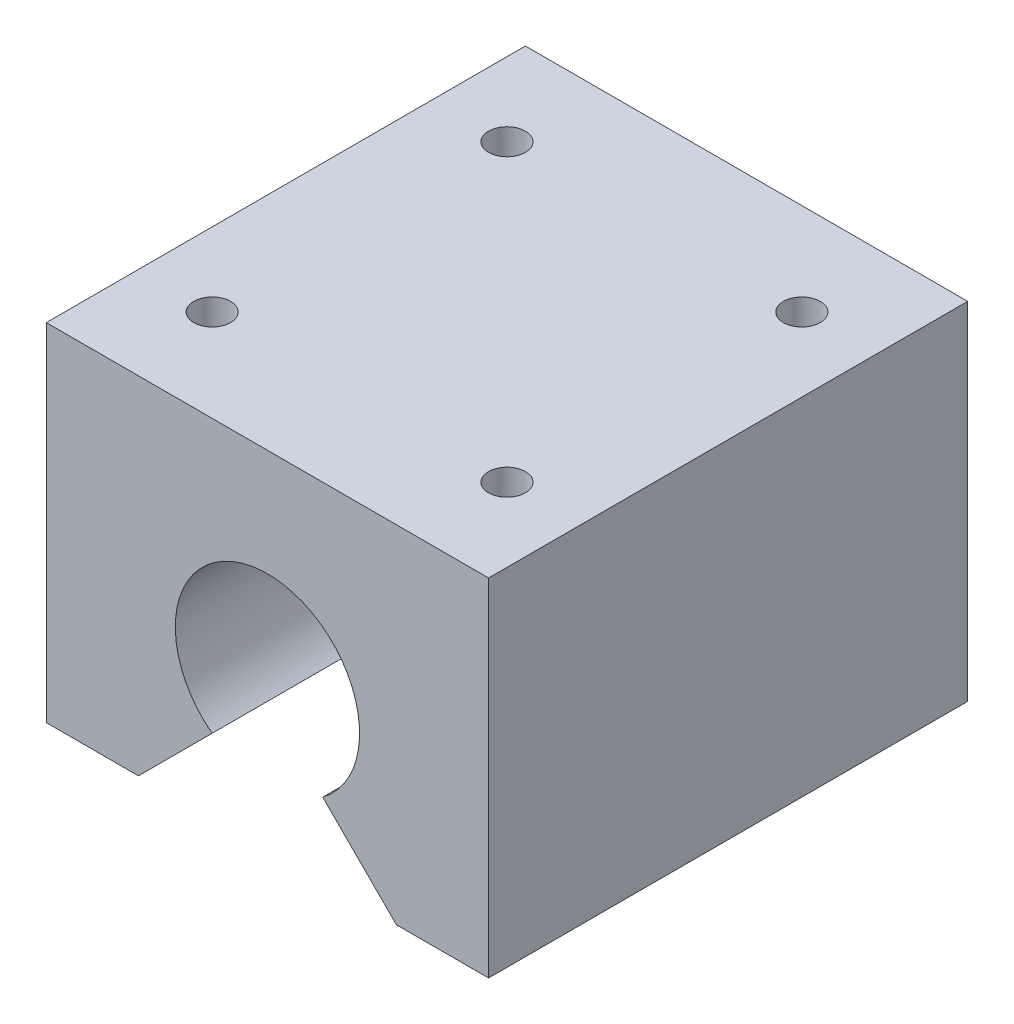
ISO-10303-21;
HEADER;
FILE_DESCRIPTION(('STEP AP214'),'2;1');
FILE_NAME('part.step','',(''),(''),'','','');
FILE_SCHEMA(('AUTOMOTIVE_DESIGN { 1 0 10303 214 1 1 1 1 }'));
ENDSEC;
DATA;
#1=APPLICATION_CONTEXT('core data for automotive mechanical design processes');
#2=APPLICATION_PROTOCOL_DEFINITION('international standard','automotive_design',2000,#1);
#3=PRODUCT_CONTEXT('',#1,'mechanical');
#4=PRODUCT('Part','Part','',(#3));
#5=PRODUCT_RELATED_PRODUCT_CATEGORY('part','',(#4));
#6=PRODUCT_DEFINITION_FORMATION('','',#4);
#7=PRODUCT_DEFINITION_CONTEXT('part definition',#1,'design');
#8=PRODUCT_DEFINITION('design','',#6,#7);
#9=PRODUCT_DEFINITION_SHAPE('','',#8);
#10=(LENGTH_UNIT() NAMED_UNIT(*) SI_UNIT(.MILLI.,.METRE.));
#11=(NAMED_UNIT(*) PLANE_ANGLE_UNIT() SI_UNIT($,.RADIAN.));
#12=(NAMED_UNIT(*) SI_UNIT($,.STERADIAN.) SOLID_ANGLE_UNIT());
#13=UNCERTAINTY_MEASURE_WITH_UNIT(LENGTH_MEASURE(1.E-05),#10,'distance_accuracy_value','');
#14=(GEOMETRIC_REPRESENTATION_CONTEXT(3) GLOBAL_UNCERTAINTY_ASSIGNED_CONTEXT((#13)) GLOBAL_UNIT_ASSIGNED_CONTEXT((#10,
#11,#12)) REPRESENTATION_CONTEXT('',''));
#15=CARTESIAN_POINT('',(0.,0.,0.));
#16=DIRECTION('',(0.,0.,1.));
#17=DIRECTION('',(1.,0.,0.));
#18=AXIS2_PLACEMENT_3D('',#15,#16,#17);
#19=CARTESIAN_POINT('',(17.5,0.,32.5));
#20=DIRECTION('',(0.,1.,0.));
#21=DIRECTION('',(-1.,0.,0.));
#22=AXIS2_PLACEMENT_3D('',#19,#20,#21);
#23=PLANE('',#22);
#24=DIRECTION('',(1.,0.,0.));
#25=VECTOR('',#24,1.);
#26=CARTESIAN_POINT('',(17.5,0.,-32.5));
#27=LINE('',#26,#25);
#28=CARTESIAN_POINT('',(17.5,0.,-32.5));
#29=VERTEX_POINT('',#28);
#30=CARTESIAN_POINT('',(30.,0.,-32.5));
#31=VERTEX_POINT('',#30);
#32=EDGE_CURVE('E136',#29,#31,#27,.T.);
#33=ORIENTED_EDGE('',*,*,#32,.T.);
#34=DIRECTION('',(0.,0.,-1.));
#35=VECTOR('',#34,1.);
#36=CARTESIAN_POINT('',(30.,0.,32.5));
#37=LINE('',#36,#35);
#38=CARTESIAN_POINT('',(30.,0.,32.5));
#39=VERTEX_POINT('',#38);
#40=EDGE_CURVE('E11',#39,#31,#37,.T.);
#41=ORIENTED_EDGE('',*,*,#40,.F.);
#42=DIRECTION('',(1.,0.,0.));
#43=VECTOR('',#42,1.);
#44=CARTESIAN_POINT('',(17.5,0.,32.5));
#45=LINE('',#44,#43);
#46=CARTESIAN_POINT('',(17.5,0.,32.5));
#47=VERTEX_POINT('',#46);
#48=EDGE_CURVE('E151',#47,#39,#45,.T.);
#49=ORIENTED_EDGE('',*,*,#48,.F.);
#50=DIRECTION('',(0.,0.,-1.));
#51=VECTOR('',#50,1.);
#52=CARTESIAN_POINT('',(17.5,0.,32.5));
#53=LINE('',#52,#51);
#54=EDGE_CURVE('E132',#47,#29,#53,.T.);
#55=ORIENTED_EDGE('',*,*,#54,.T.);
#56=EDGE_LOOP('',(#33,#41,#49,#55));
#57=FACE_BOUND('',#56,.T.);
#58=ADVANCED_FACE('F37',(#57),#23,.F.);
#59=CARTESIAN_POINT('',(30.,47.,32.5));
#60=DIRECTION('',(-1.,0.,0.));
#61=DIRECTION('',(0.,-1.,0.));
#62=AXIS2_PLACEMENT_3D('',#59,#60,#61);
#63=PLANE('',#62);
#64=DIRECTION('',(0.,1.,0.));
#65=VECTOR('',#64,1.);
#66=CARTESIAN_POINT('',(30.,47.,-32.5));
#67=LINE('',#66,#65);
#68=CARTESIAN_POINT('',(30.,47.,-32.5));
#69=VERTEX_POINT('',#68);
#70=EDGE_CURVE('E139',#31,#69,#67,.T.);
#71=ORIENTED_EDGE('',*,*,#70,.T.);
#72=DIRECTION('',(0.,0.,-1.));
#73=VECTOR('',#72,1.);
#74=CARTESIAN_POINT('',(30.,47.,32.5));
#75=LINE('',#74,#73);
#76=CARTESIAN_POINT('',(30.,47.,32.5));
#77=VERTEX_POINT('',#76);
#78=EDGE_CURVE('E45',#77,#69,#75,.T.);
#79=ORIENTED_EDGE('',*,*,#78,.F.);
#80=DIRECTION('',(0.,1.,0.));
#81=VECTOR('',#80,1.);
#82=CARTESIAN_POINT('',(30.,47.,32.5));
#83=LINE('',#82,#81);
#84=EDGE_CURVE('E97',#39,#77,#83,.T.);
#85=ORIENTED_EDGE('',*,*,#84,.F.);
#86=ORIENTED_EDGE('',*,*,#40,.T.);
#87=EDGE_LOOP('',(#71,#79,#85,#86));
#88=FACE_BOUND('',#87,.T.);
#89=ADVANCED_FACE('F212',(#88),#63,.F.);
#90=CARTESIAN_POINT('',(-30.,47.,32.5));
#91=DIRECTION('',(0.,-1.,0.));
#92=DIRECTION('',(1.,0.,0.));
#93=AXIS2_PLACEMENT_3D('',#90,#91,#92);
#94=PLANE('',#93);
#95=CARTESIAN_POINT('',(-20.,47.,-20.));
#96=DIRECTION('',(0.,1.,0.));
#97=DIRECTION('',(0.,0.,1.));
#98=AXIS2_PLACEMENT_3D('',#95,#96,#97);
#99=CIRCLE('',#98,2.5);
#100=CARTESIAN_POINT('',(-20.,47.,-17.5));
#101=VERTEX_POINT('',#100);
#102=EDGE_CURVE('E204',#101,#101,#99,.T.);
#103=ORIENTED_EDGE('',*,*,#102,.F.);
#104=EDGE_LOOP('',(#103));
#105=FACE_BOUND('',#104,.T.);
#106=CARTESIAN_POINT('',(20.,47.,-20.));
#107=DIRECTION('',(0.,1.,0.));
#108=DIRECTION('',(0.,0.,1.));
#109=AXIS2_PLACEMENT_3D('',#106,#107,#108);
#110=CIRCLE('',#109,2.5);
#111=CARTESIAN_POINT('',(20.,47.,-17.5));
#112=VERTEX_POINT('',#111);
#113=EDGE_CURVE('E198',#112,#112,#110,.T.);
#114=ORIENTED_EDGE('',*,*,#113,.F.);
#115=EDGE_LOOP('',(#114));
#116=FACE_BOUND('',#115,.T.);
#117=CARTESIAN_POINT('',(20.,47.,20.));
#118=DIRECTION('',(0.,1.,0.));
#119=DIRECTION('',(0.,0.,1.));
#120=AXIS2_PLACEMENT_3D('',#117,#118,#119);
#121=CIRCLE('',#120,2.5);
#122=CARTESIAN_POINT('',(20.,47.,22.5));
#123=VERTEX_POINT('',#122);
#124=EDGE_CURVE('E192',#123,#123,#121,.T.);
#125=ORIENTED_EDGE('',*,*,#124,.F.);
#126=EDGE_LOOP('',(#125));
#127=FACE_BOUND('',#126,.T.);
#128=CARTESIAN_POINT('',(-20.,47.,20.));
#129=DIRECTION('',(0.,1.,0.));
#130=DIRECTION('',(0.,0.,1.));
#131=AXIS2_PLACEMENT_3D('',#128,#129,#130);
#132=CIRCLE('',#131,2.5);
#133=CARTESIAN_POINT('',(-20.,47.,22.5));
#134=VERTEX_POINT('',#133);
#135=EDGE_CURVE('E186',#134,#134,#132,.T.);
#136=ORIENTED_EDGE('',*,*,#135,.F.);
#137=EDGE_LOOP('',(#136));
#138=FACE_BOUND('',#137,.T.);
#139=DIRECTION('',(-1.,0.,0.));
#140=VECTOR('',#139,1.);
#141=CARTESIAN_POINT('',(-30.,47.,-32.5));
#142=LINE('',#141,#140);
#143=CARTESIAN_POINT('',(-30.,47.,-32.5));
#144=VERTEX_POINT('',#143);
#145=EDGE_CURVE('E142',#69,#144,#142,.T.);
#146=ORIENTED_EDGE('',*,*,#145,.T.);
#147=DIRECTION('',(0.,0.,-1.));
#148=VECTOR('',#147,1.);
#149=CARTESIAN_POINT('',(-30.,47.,32.5));
#150=LINE('',#149,#148);
#151=CARTESIAN_POINT('',(-30.,47.,32.5));
#152=VERTEX_POINT('',#151);
#153=EDGE_CURVE('E158',#152,#144,#150,.T.);
#154=ORIENTED_EDGE('',*,*,#153,.F.);
#155=DIRECTION('',(-1.,0.,0.));
#156=VECTOR('',#155,1.);
#157=CARTESIAN_POINT('',(-30.,47.,32.5));
#158=LINE('',#157,#156);
#159=EDGE_CURVE('E166',#77,#152,#158,.T.);
#160=ORIENTED_EDGE('',*,*,#159,.F.);
#161=ORIENTED_EDGE('',*,*,#78,.T.);
#162=EDGE_LOOP('',(#146,#154,#160,#161));
#163=FACE_BOUND('',#162,.T.);
#164=ADVANCED_FACE('F164',(#105,#116,#127,#138,#163),#94,.F.);
#165=CARTESIAN_POINT('',(-30.,47.,32.5));
#166=DIRECTION('',(1.,0.,0.));
#167=DIRECTION('',(0.,1.,0.));
#168=AXIS2_PLACEMENT_3D('',#165,#166,#167);
#169=PLANE('',#168);
#170=DIRECTION('',(0.,-1.,0.));
#171=VECTOR('',#170,1.);
#172=CARTESIAN_POINT('',(-30.,47.,-32.5));
#173=LINE('',#172,#171);
#174=CARTESIAN_POINT('',(-30.,0.,-32.5));
#175=VERTEX_POINT('',#174);
#176=EDGE_CURVE('E144',#144,#175,#173,.T.);
#177=ORIENTED_EDGE('',*,*,#176,.T.);
#178=DIRECTION('',(0.,0.,-1.));
#179=VECTOR('',#178,1.);
#180=CARTESIAN_POINT('',(-30.,0.,32.5));
#181=LINE('',#180,#179);
#182=CARTESIAN_POINT('',(-30.,0.,32.5));
#183=VERTEX_POINT('',#182);
#184=EDGE_CURVE('E155',#183,#175,#181,.T.);
#185=ORIENTED_EDGE('',*,*,#184,.F.);
#186=DIRECTION('',(0.,-1.,0.));
#187=VECTOR('',#186,1.);
#188=CARTESIAN_POINT('',(-30.,47.,32.5));
#189=LINE('',#188,#187);
#190=EDGE_CURVE('E178',#152,#183,#189,.T.);
#191=ORIENTED_EDGE('',*,*,#190,.F.);
#192=ORIENTED_EDGE('',*,*,#153,.T.);
#193=EDGE_LOOP('',(#177,#185,#191,#192));
#194=FACE_BOUND('',#193,.T.);
#195=ADVANCED_FACE('F174',(#194),#169,.F.);
#196=CARTESIAN_POINT('',(-30.,0.,32.5));
#197=DIRECTION('',(0.,1.,0.));
#198=DIRECTION('',(-1.,0.,0.));
#199=AXIS2_PLACEMENT_3D('',#196,#197,#198);
#200=PLANE('',#199);
#201=DIRECTION('',(1.,0.,0.));
#202=VECTOR('',#201,1.);
#203=CARTESIAN_POINT('',(-30.,0.,-32.5));
#204=LINE('',#203,#202);
#205=CARTESIAN_POINT('',(-17.5,0.,-32.5));
#206=VERTEX_POINT('',#205);
#207=EDGE_CURVE('E146',#175,#206,#204,.T.);
#208=ORIENTED_EDGE('',*,*,#207,.T.);
#209=DIRECTION('',(0.,0.,-1.));
#210=VECTOR('',#209,1.);
#211=CARTESIAN_POINT('',(-17.5,0.,32.5));
#212=LINE('',#211,#210);
#213=CARTESIAN_POINT('',(-17.5,0.,32.5));
#214=VERTEX_POINT('',#213);
#215=EDGE_CURVE('E127',#214,#206,#212,.T.);
#216=ORIENTED_EDGE('',*,*,#215,.F.);
#217=DIRECTION('',(1.,0.,0.));
#218=VECTOR('',#217,1.);
#219=CARTESIAN_POINT('',(-30.,0.,32.5));
#220=LINE('',#219,#218);
#221=EDGE_CURVE('E118',#183,#214,#220,.T.);
#222=ORIENTED_EDGE('',*,*,#221,.F.);
#223=ORIENTED_EDGE('',*,*,#184,.T.);
#224=EDGE_LOOP('',(#208,#216,#222,#223));
#225=FACE_BOUND('',#224,.T.);
#226=ADVANCED_FACE('F177',(#225),#200,.F.);
#227=CARTESIAN_POINT('',(-17.5,0.,32.5));
#228=DIRECTION('',(-0.707106781186549,0.707106781186546,0.));
#229=DIRECTION('',(-0.707106781186546,-0.707106781186549,0.));
#230=AXIS2_PLACEMENT_3D('',#227,#228,#229);
#231=PLANE('',#230);
#232=DIRECTION('',(0.707106781186546,0.707106781186549,0.));
#233=VECTOR('',#232,1.);
#234=CARTESIAN_POINT('',(-17.5,0.,-32.5));
#235=LINE('',#234,#233);
#236=CARTESIAN_POINT('',(-7.50000000000001,10.,-32.5));
#237=VERTEX_POINT('',#236);
#238=EDGE_CURVE('E126',#206,#237,#235,.T.);
#239=ORIENTED_EDGE('',*,*,#238,.T.);
#240=DIRECTION('',(0.,0.,-1.));
#241=VECTOR('',#240,1.);
#242=CARTESIAN_POINT('',(-7.50000000000001,10.,32.5));
#243=LINE('',#242,#241);
#244=CARTESIAN_POINT('',(-7.50000000000001,10.,32.5));
#245=VERTEX_POINT('',#244);
#246=EDGE_CURVE('E123',#245,#237,#243,.T.);
#247=ORIENTED_EDGE('',*,*,#246,.F.);
#248=DIRECTION('',(0.707106781186546,0.707106781186549,0.));
#249=VECTOR('',#248,1.);
#250=CARTESIAN_POINT('',(-17.5,0.,32.5));
#251=LINE('',#250,#249);
#252=EDGE_CURVE('E112',#214,#245,#251,.T.);
#253=ORIENTED_EDGE('',*,*,#252,.F.);
#254=ORIENTED_EDGE('',*,*,#215,.T.);
#255=EDGE_LOOP('',(#239,#247,#253,#254));
#256=FACE_BOUND('',#255,.T.);
#257=ADVANCED_FACE('F124',(#256),#231,.F.);
#258=CARTESIAN_POINT('',(0.,20.,32.5));
#259=DIRECTION('',(0.,0.,-1.));
#260=DIRECTION('',(-1.,0.,0.));
#261=AXIS2_PLACEMENT_3D('',#258,#259,#260);
#262=CYLINDRICAL_SURFACE('',#261,12.5);
#263=CARTESIAN_POINT('',(0.,20.,-32.5));
#264=DIRECTION('',(0.,0.,-1.));
#265=DIRECTION('',(1.,0.,0.));
#266=AXIS2_PLACEMENT_3D('',#263,#264,#265);
#267=CIRCLE('',#266,12.5);
#268=CARTESIAN_POINT('',(7.50000000000002,10.,-32.5));
#269=VERTEX_POINT('',#268);
#270=EDGE_CURVE('E83',#237,#269,#267,.T.);
#271=ORIENTED_EDGE('',*,*,#270,.T.);
#272=DIRECTION('',(0.,0.,-1.));
#273=VECTOR('',#272,1.);
#274=CARTESIAN_POINT('',(7.50000000000002,10.,32.5));
#275=LINE('',#274,#273);
#276=CARTESIAN_POINT('',(7.50000000000002,10.,32.5));
#277=VERTEX_POINT('',#276);
#278=EDGE_CURVE('E128',#277,#269,#275,.T.);
#279=ORIENTED_EDGE('',*,*,#278,.F.);
#280=CARTESIAN_POINT('',(0.,20.,32.5));
#281=DIRECTION('',(0.,0.,-1.));
#282=DIRECTION('',(1.,0.,0.));
#283=AXIS2_PLACEMENT_3D('',#280,#281,#282);
#284=CIRCLE('',#283,12.5);
#285=EDGE_CURVE('E116',#245,#277,#284,.T.);
#286=ORIENTED_EDGE('',*,*,#285,.F.);
#287=ORIENTED_EDGE('',*,*,#246,.T.);
#288=EDGE_LOOP('',(#271,#279,#286,#287));
#289=FACE_BOUND('',#288,.T.);
#290=ADVANCED_FACE('F130',(#289),#262,.F.);
#291=CARTESIAN_POINT('',(17.5,0.,32.5));
#292=DIRECTION('',(0.707106781186549,0.707106781186546,0.));
#293=DIRECTION('',(-0.707106781186546,0.707106781186549,0.));
#294=AXIS2_PLACEMENT_3D('',#291,#292,#293);
#295=PLANE('',#294);
#296=DIRECTION('',(0.707106781186547,-0.707106781186549,0.));
#297=VECTOR('',#296,1.);
#298=CARTESIAN_POINT('',(17.5,0.,-32.5));
#299=LINE('',#298,#297);
#300=EDGE_CURVE('E89',#269,#29,#299,.T.);
#301=ORIENTED_EDGE('',*,*,#300,.T.);
#302=ORIENTED_EDGE('',*,*,#54,.F.);
#303=DIRECTION('',(0.707106781186547,-0.707106781186549,0.));
#304=VECTOR('',#303,1.);
#305=CARTESIAN_POINT('',(17.5,0.,32.5));
#306=LINE('',#305,#304);
#307=EDGE_CURVE('E53',#277,#47,#306,.T.);
#308=ORIENTED_EDGE('',*,*,#307,.F.);
#309=ORIENTED_EDGE('',*,*,#278,.T.);
#310=EDGE_LOOP('',(#301,#302,#308,#309));
#311=FACE_BOUND('',#310,.T.);
#312=ADVANCED_FACE('F243',(#311),#295,.F.);
#313=CARTESIAN_POINT('',(0.,20.,32.5));
#314=DIRECTION('',(0.,0.,1.));
#315=DIRECTION('',(1.,0.,0.));
#316=AXIS2_PLACEMENT_3D('',#313,#314,#315);
#317=PLANE('',#316);
#318=ORIENTED_EDGE('',*,*,#48,.T.);
#319=ORIENTED_EDGE('',*,*,#84,.T.);
#320=ORIENTED_EDGE('',*,*,#159,.T.);
#321=ORIENTED_EDGE('',*,*,#190,.T.);
#322=ORIENTED_EDGE('',*,*,#221,.T.);
#323=ORIENTED_EDGE('',*,*,#252,.T.);
#324=ORIENTED_EDGE('',*,*,#285,.T.);
#325=ORIENTED_EDGE('',*,*,#307,.T.);
#326=EDGE_LOOP('',(#318,#319,#320,#321,#322,#323,#324,#325));
#327=FACE_BOUND('',#326,.T.);
#328=ADVANCED_FACE('F114',(#327),#317,.T.);
#329=CARTESIAN_POINT('',(0.,20.,-32.5));
#330=DIRECTION('',(0.,0.,1.));
#331=DIRECTION('',(1.,0.,0.));
#332=AXIS2_PLACEMENT_3D('',#329,#330,#331);
#333=PLANE('',#332);
#334=ORIENTED_EDGE('',*,*,#32,.F.);
#335=ORIENTED_EDGE('',*,*,#300,.F.);
#336=ORIENTED_EDGE('',*,*,#270,.F.);
#337=ORIENTED_EDGE('',*,*,#238,.F.);
#338=ORIENTED_EDGE('',*,*,#207,.F.);
#339=ORIENTED_EDGE('',*,*,#176,.F.);
#340=ORIENTED_EDGE('',*,*,#145,.F.);
#341=ORIENTED_EDGE('',*,*,#70,.F.);
#342=EDGE_LOOP('',(#334,#335,#336,#337,#338,#339,#340,#341));
#343=FACE_BOUND('',#342,.T.);
#344=ADVANCED_FACE('F170',(#343),#333,.F.);
#345=CARTESIAN_POINT('',(-20.,37.,20.));
#346=DIRECTION('',(0.,1.,0.));
#347=DIRECTION('',(0.,0.,1.));
#348=AXIS2_PLACEMENT_3D('',#345,#346,#347);
#349=CONICAL_SURFACE('',#348,2.5,1.02974425867665);
#350=CARTESIAN_POINT('',(-20.,35.4978484524311,20.));
#351=VERTEX_POINT('',#350);
#352=VERTEX_LOOP('',#351);
#353=FACE_BOUND('',#352,.T.);
#354=CARTESIAN_POINT('',(-20.,37.,20.));
#355=DIRECTION('',(0.,1.,0.));
#356=DIRECTION('',(0.,0.,1.));
#357=AXIS2_PLACEMENT_3D('',#354,#355,#356);
#358=CIRCLE('',#357,2.5);
#359=CARTESIAN_POINT('',(-20.,37.,22.5));
#360=VERTEX_POINT('',#359);
#361=EDGE_CURVE('E140',#360,#360,#358,.T.);
#362=ORIENTED_EDGE('',*,*,#361,.T.);
#363=EDGE_LOOP('',(#362));
#364=FACE_BOUND('',#363,.T.);
#365=ADVANCED_FACE('F223',(#353,#364),#349,.F.);
#366=CARTESIAN_POINT('',(-20.,47.,20.));
#367=DIRECTION('',(0.,1.,0.));
#368=DIRECTION('',(0.,0.,1.));
#369=AXIS2_PLACEMENT_3D('',#366,#367,#368);
#370=CYLINDRICAL_SURFACE('',#369,2.5);
#371=ORIENTED_EDGE('',*,*,#361,.F.);
#372=EDGE_LOOP('',(#371));
#373=FACE_BOUND('',#372,.T.);
#374=ORIENTED_EDGE('',*,*,#135,.T.);
#375=EDGE_LOOP('',(#374));
#376=FACE_BOUND('',#375,.T.);
#377=ADVANCED_FACE('F220',(#373,#376),#370,.F.);
#378=CARTESIAN_POINT('',(20.,37.,20.));
#379=DIRECTION('',(0.,1.,0.));
#380=DIRECTION('',(0.,0.,1.));
#381=AXIS2_PLACEMENT_3D('',#378,#379,#380);
#382=CONICAL_SURFACE('',#381,2.5,1.02974425867665);
#383=CARTESIAN_POINT('',(20.,35.4978484524311,20.));
#384=VERTEX_POINT('',#383);
#385=VERTEX_LOOP('',#384);
#386=FACE_BOUND('',#385,.T.);
#387=CARTESIAN_POINT('',(20.,37.,20.));
#388=DIRECTION('',(0.,1.,0.));
#389=DIRECTION('',(0.,0.,1.));
#390=AXIS2_PLACEMENT_3D('',#387,#388,#389);
#391=CIRCLE('',#390,2.5);
#392=CARTESIAN_POINT('',(20.,37.,22.5));
#393=VERTEX_POINT('',#392);
#394=EDGE_CURVE('E189',#393,#393,#391,.T.);
#395=ORIENTED_EDGE('',*,*,#394,.T.);
#396=EDGE_LOOP('',(#395));
#397=FACE_BOUND('',#396,.T.);
#398=ADVANCED_FACE('F222',(#386,#397),#382,.F.);
#399=CARTESIAN_POINT('',(20.,47.,20.));
#400=DIRECTION('',(0.,1.,0.));
#401=DIRECTION('',(0.,0.,1.));
#402=AXIS2_PLACEMENT_3D('',#399,#400,#401);
#403=CYLINDRICAL_SURFACE('',#402,2.5);
#404=ORIENTED_EDGE('',*,*,#394,.F.);
#405=EDGE_LOOP('',(#404));
#406=FACE_BOUND('',#405,.T.);
#407=ORIENTED_EDGE('',*,*,#124,.T.);
#408=EDGE_LOOP('',(#407));
#409=FACE_BOUND('',#408,.T.);
#410=ADVANCED_FACE('F230',(#406,#409),#403,.F.);
#411=CARTESIAN_POINT('',(20.,37.,-20.));
#412=DIRECTION('',(0.,1.,0.));
#413=DIRECTION('',(0.,0.,1.));
#414=AXIS2_PLACEMENT_3D('',#411,#412,#413);
#415=CONICAL_SURFACE('',#414,2.5,1.02974425867665);
#416=CARTESIAN_POINT('',(20.,35.4978484524311,-20.));
#417=VERTEX_POINT('',#416);
#418=VERTEX_LOOP('',#417);
#419=FACE_BOUND('',#418,.T.);
#420=CARTESIAN_POINT('',(20.,37.,-20.));
#421=DIRECTION('',(0.,1.,0.));
#422=DIRECTION('',(0.,0.,1.));
#423=AXIS2_PLACEMENT_3D('',#420,#421,#422);
#424=CIRCLE('',#423,2.5);
#425=CARTESIAN_POINT('',(20.,37.,-17.5));
#426=VERTEX_POINT('',#425);
#427=EDGE_CURVE('E195',#426,#426,#424,.T.);
#428=ORIENTED_EDGE('',*,*,#427,.T.);
#429=EDGE_LOOP('',(#428));
#430=FACE_BOUND('',#429,.T.);
#431=ADVANCED_FACE('F326',(#419,#430),#415,.F.);
#432=CARTESIAN_POINT('',(20.,47.,-20.));
#433=DIRECTION('',(0.,1.,0.));
#434=DIRECTION('',(0.,0.,1.));
#435=AXIS2_PLACEMENT_3D('',#432,#433,#434);
#436=CYLINDRICAL_SURFACE('',#435,2.5);
#437=ORIENTED_EDGE('',*,*,#427,.F.);
#438=EDGE_LOOP('',(#437));
#439=FACE_BOUND('',#438,.T.);
#440=ORIENTED_EDGE('',*,*,#113,.T.);
#441=EDGE_LOOP('',(#440));
#442=FACE_BOUND('',#441,.T.);
#443=ADVANCED_FACE('F337',(#439,#442),#436,.F.);
#444=CARTESIAN_POINT('',(-20.,37.,-20.));
#445=DIRECTION('',(0.,1.,0.));
#446=DIRECTION('',(0.,0.,1.));
#447=AXIS2_PLACEMENT_3D('',#444,#445,#446);
#448=CONICAL_SURFACE('',#447,2.5,1.02974425867665);
#449=CARTESIAN_POINT('',(-20.,35.4978484524311,-20.));
#450=VERTEX_POINT('',#449);
#451=VERTEX_LOOP('',#450);
#452=FACE_BOUND('',#451,.T.);
#453=CARTESIAN_POINT('',(-20.,37.,-20.));
#454=DIRECTION('',(0.,1.,0.));
#455=DIRECTION('',(0.,0.,1.));
#456=AXIS2_PLACEMENT_3D('',#453,#454,#455);
#457=CIRCLE('',#456,2.5);
#458=CARTESIAN_POINT('',(-20.,37.,-17.5));
#459=VERTEX_POINT('',#458);
#460=EDGE_CURVE('E201',#459,#459,#457,.T.);
#461=ORIENTED_EDGE('',*,*,#460,.T.);
#462=EDGE_LOOP('',(#461));
#463=FACE_BOUND('',#462,.T.);
#464=ADVANCED_FACE('F347',(#452,#463),#448,.F.);
#465=CARTESIAN_POINT('',(-20.,47.,-20.));
#466=DIRECTION('',(0.,1.,0.));
#467=DIRECTION('',(0.,0.,1.));
#468=AXIS2_PLACEMENT_3D('',#465,#466,#467);
#469=CYLINDRICAL_SURFACE('',#468,2.5);
#470=ORIENTED_EDGE('',*,*,#460,.F.);
#471=EDGE_LOOP('',(#470));
#472=FACE_BOUND('',#471,.T.);
#473=ORIENTED_EDGE('',*,*,#102,.T.);
#474=EDGE_LOOP('',(#473));
#475=FACE_BOUND('',#474,.T.);
#476=ADVANCED_FACE('F208',(#472,#475),#469,.F.);
#477=CLOSED_SHELL('',(#58,#89,#164,#195,#226,#257,#290,#312,#328,#344,#365,#377,#398,#410,#431,
#443,#464,#476));
#478=MANIFOLD_SOLID_BREP('B2',#477);
#479=ADVANCED_BREP_SHAPE_REPRESENTATION('',(#18,#478),#14);
#480=SHAPE_DEFINITION_REPRESENTATION(#9,#479);
ENDSEC;
END-ISO-10303-21;
